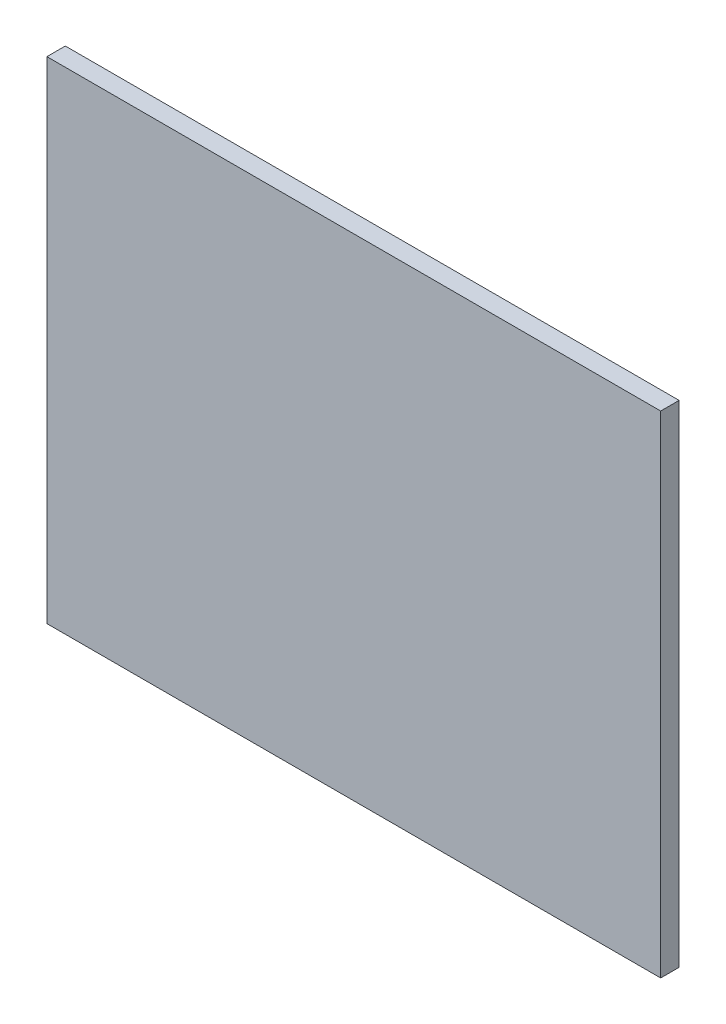
ISO-10303-21;
HEADER;
FILE_DESCRIPTION(('STEP AP214'),'2;1');
FILE_NAME('part.step','',(''),(''),'','','');
FILE_SCHEMA(('AUTOMOTIVE_DESIGN { 1 0 10303 214 1 1 1 1 }'));
ENDSEC;
DATA;
#1=APPLICATION_CONTEXT('core data for automotive mechanical design processes');
#2=APPLICATION_PROTOCOL_DEFINITION('international standard','automotive_design',2000,#1);
#3=PRODUCT_CONTEXT('',#1,'mechanical');
#4=PRODUCT('Part','Part','',(#3));
#5=PRODUCT_RELATED_PRODUCT_CATEGORY('part','',(#4));
#6=PRODUCT_DEFINITION_FORMATION('','',#4);
#7=PRODUCT_DEFINITION_CONTEXT('part definition',#1,'design');
#8=PRODUCT_DEFINITION('design','',#6,#7);
#9=PRODUCT_DEFINITION_SHAPE('','',#8);
#10=(LENGTH_UNIT() NAMED_UNIT(*) SI_UNIT(.MILLI.,.METRE.));
#11=(NAMED_UNIT(*) PLANE_ANGLE_UNIT() SI_UNIT($,.RADIAN.));
#12=(NAMED_UNIT(*) SI_UNIT($,.STERADIAN.) SOLID_ANGLE_UNIT());
#13=UNCERTAINTY_MEASURE_WITH_UNIT(LENGTH_MEASURE(1.E-05),#10,'distance_accuracy_value','');
#14=(GEOMETRIC_REPRESENTATION_CONTEXT(3) GLOBAL_UNCERTAINTY_ASSIGNED_CONTEXT((#13)) GLOBAL_UNIT_ASSIGNED_CONTEXT((#10,
#11,#12)) REPRESENTATION_CONTEXT('',''));
#15=CARTESIAN_POINT('',(0.,0.,0.));
#16=DIRECTION('',(0.,0.,1.));
#17=DIRECTION('',(1.,0.,0.));
#18=AXIS2_PLACEMENT_3D('',#15,#16,#17);
#19=CARTESIAN_POINT('',(-5.35211267605634,3.23943661971831,3.));
#20=DIRECTION('',(1.,0.,0.));
#21=DIRECTION('',(0.,1.,0.));
#22=AXIS2_PLACEMENT_3D('',#19,#20,#21);
#23=PLANE('',#22);
#24=DIRECTION('',(0.,-1.,0.));
#25=VECTOR('',#24,1.);
#26=CARTESIAN_POINT('',(-5.35211267605634,3.23943661971831,0.));
#27=LINE('',#26,#25);
#28=CARTESIAN_POINT('',(-5.35211267605634,3.23943661971831,0.));
#29=VERTEX_POINT('',#28);
#30=CARTESIAN_POINT('',(-5.35211267605633,-76.7605633802817,0.));
#31=VERTEX_POINT('',#30);
#32=EDGE_CURVE('E97',#29,#31,#27,.T.);
#33=ORIENTED_EDGE('',*,*,#32,.T.);
#34=DIRECTION('',(0.,0.,-1.));
#35=VECTOR('',#34,1.);
#36=CARTESIAN_POINT('',(-5.35211267605633,-76.7605633802817,3.));
#37=LINE('',#36,#35);
#38=CARTESIAN_POINT('',(-5.35211267605633,-76.7605633802817,3.));
#39=VERTEX_POINT('',#38);
#40=EDGE_CURVE('E11',#39,#31,#37,.T.);
#41=ORIENTED_EDGE('',*,*,#40,.F.);
#42=DIRECTION('',(0.,-1.,0.));
#43=VECTOR('',#42,1.);
#44=CARTESIAN_POINT('',(-5.35211267605634,3.23943661971831,3.));
#45=LINE('',#44,#43);
#46=CARTESIAN_POINT('',(-5.35211267605634,3.23943661971831,3.));
#47=VERTEX_POINT('',#46);
#48=EDGE_CURVE('E85',#47,#39,#45,.T.);
#49=ORIENTED_EDGE('',*,*,#48,.F.);
#50=DIRECTION('',(0.,0.,-1.));
#51=VECTOR('',#50,1.);
#52=CARTESIAN_POINT('',(-5.35211267605634,3.23943661971831,3.));
#53=LINE('',#52,#51);
#54=EDGE_CURVE('E93',#47,#29,#53,.T.);
#55=ORIENTED_EDGE('',*,*,#54,.T.);
#56=EDGE_LOOP('',(#33,#41,#49,#55));
#57=FACE_BOUND('',#56,.T.);
#58=ADVANCED_FACE('F34',(#57),#23,.F.);
#59=CARTESIAN_POINT('',(-5.35211267605633,-76.7605633802817,3.));
#60=DIRECTION('',(0.,1.,0.));
#61=DIRECTION('',(0.,0.,1.));
#62=AXIS2_PLACEMENT_3D('',#59,#60,#61);
#63=PLANE('',#62);
#64=DIRECTION('',(1.,0.,0.));
#65=VECTOR('',#64,1.);
#66=CARTESIAN_POINT('',(-5.35211267605633,-76.7605633802817,0.));
#67=LINE('',#66,#65);
#68=CARTESIAN_POINT('',(94.6478873239437,-76.7605633802817,0.));
#69=VERTEX_POINT('',#68);
#70=EDGE_CURVE('E89',#31,#69,#67,.T.);
#71=ORIENTED_EDGE('',*,*,#70,.T.);
#72=DIRECTION('',(0.,0.,-1.));
#73=VECTOR('',#72,1.);
#74=CARTESIAN_POINT('',(94.6478873239437,-76.7605633802817,3.));
#75=LINE('',#74,#73);
#76=CARTESIAN_POINT('',(94.6478873239437,-76.7605633802817,3.));
#77=VERTEX_POINT('',#76);
#78=EDGE_CURVE('E42',#77,#69,#75,.T.);
#79=ORIENTED_EDGE('',*,*,#78,.F.);
#80=DIRECTION('',(1.,0.,0.));
#81=VECTOR('',#80,1.);
#82=CARTESIAN_POINT('',(-5.35211267605633,-76.7605633802817,3.));
#83=LINE('',#82,#81);
#84=EDGE_CURVE('E80',#39,#77,#83,.T.);
#85=ORIENTED_EDGE('',*,*,#84,.F.);
#86=ORIENTED_EDGE('',*,*,#40,.T.);
#87=EDGE_LOOP('',(#71,#79,#85,#86));
#88=FACE_BOUND('',#87,.T.);
#89=ADVANCED_FACE('F88',(#88),#63,.F.);
#90=CARTESIAN_POINT('',(94.6478873239437,3.23943661971831,3.));
#91=DIRECTION('',(-1.,0.,0.));
#92=DIRECTION('',(0.,-1.,0.));
#93=AXIS2_PLACEMENT_3D('',#90,#91,#92);
#94=PLANE('',#93);
#95=DIRECTION('',(0.,1.,0.));
#96=VECTOR('',#95,1.);
#97=CARTESIAN_POINT('',(94.6478873239437,3.23943661971831,0.));
#98=LINE('',#97,#96);
#99=CARTESIAN_POINT('',(94.6478873239437,3.23943661971831,0.));
#100=VERTEX_POINT('',#99);
#101=EDGE_CURVE('E67',#69,#100,#98,.T.);
#102=ORIENTED_EDGE('',*,*,#101,.T.);
#103=DIRECTION('',(0.,0.,-1.));
#104=VECTOR('',#103,1.);
#105=CARTESIAN_POINT('',(94.6478873239437,3.23943661971831,3.));
#106=LINE('',#105,#104);
#107=CARTESIAN_POINT('',(94.6478873239437,3.23943661971831,3.));
#108=VERTEX_POINT('',#107);
#109=EDGE_CURVE('E90',#108,#100,#106,.T.);
#110=ORIENTED_EDGE('',*,*,#109,.F.);
#111=DIRECTION('',(0.,1.,0.));
#112=VECTOR('',#111,1.);
#113=CARTESIAN_POINT('',(94.6478873239437,3.23943661971831,3.));
#114=LINE('',#113,#112);
#115=EDGE_CURVE('E83',#77,#108,#114,.T.);
#116=ORIENTED_EDGE('',*,*,#115,.F.);
#117=ORIENTED_EDGE('',*,*,#78,.T.);
#118=EDGE_LOOP('',(#102,#110,#116,#117));
#119=FACE_BOUND('',#118,.T.);
#120=ADVANCED_FACE('F91',(#119),#94,.F.);
#121=CARTESIAN_POINT('',(-5.35211267605634,3.23943661971831,3.));
#122=DIRECTION('',(0.,-1.,0.));
#123=DIRECTION('',(0.,0.,-1.));
#124=AXIS2_PLACEMENT_3D('',#121,#122,#123);
#125=PLANE('',#124);
#126=DIRECTION('',(-1.,0.,0.));
#127=VECTOR('',#126,1.);
#128=CARTESIAN_POINT('',(-5.35211267605634,3.23943661971831,0.));
#129=LINE('',#128,#127);
#130=EDGE_CURVE('E73',#100,#29,#129,.T.);
#131=ORIENTED_EDGE('',*,*,#130,.T.);
#132=ORIENTED_EDGE('',*,*,#54,.F.);
#133=DIRECTION('',(-1.,0.,0.));
#134=VECTOR('',#133,1.);
#135=CARTESIAN_POINT('',(-5.35211267605634,3.23943661971831,3.));
#136=LINE('',#135,#134);
#137=EDGE_CURVE('E50',#108,#47,#136,.T.);
#138=ORIENTED_EDGE('',*,*,#137,.F.);
#139=ORIENTED_EDGE('',*,*,#109,.T.);
#140=EDGE_LOOP('',(#131,#132,#138,#139));
#141=FACE_BOUND('',#140,.T.);
#142=ADVANCED_FACE('F104',(#141),#125,.F.);
#143=CARTESIAN_POINT('',(0.,0.,3.));
#144=DIRECTION('',(0.,0.,1.));
#145=DIRECTION('',(1.,0.,0.));
#146=AXIS2_PLACEMENT_3D('',#143,#144,#145);
#147=PLANE('',#146);
#148=ORIENTED_EDGE('',*,*,#48,.T.);
#149=ORIENTED_EDGE('',*,*,#84,.T.);
#150=ORIENTED_EDGE('',*,*,#115,.T.);
#151=ORIENTED_EDGE('',*,*,#137,.T.);
#152=EDGE_LOOP('',(#148,#149,#150,#151));
#153=FACE_BOUND('',#152,.T.);
#154=ADVANCED_FACE('F81',(#153),#147,.T.);
#155=CARTESIAN_POINT('',(0.,0.,0.));
#156=DIRECTION('',(0.,0.,1.));
#157=DIRECTION('',(1.,0.,0.));
#158=AXIS2_PLACEMENT_3D('',#155,#156,#157);
#159=PLANE('',#158);
#160=ORIENTED_EDGE('',*,*,#32,.F.);
#161=ORIENTED_EDGE('',*,*,#130,.F.);
#162=ORIENTED_EDGE('',*,*,#101,.F.);
#163=ORIENTED_EDGE('',*,*,#70,.F.);
#164=EDGE_LOOP('',(#160,#161,#162,#163));
#165=FACE_BOUND('',#164,.T.);
#166=ADVANCED_FACE('F107',(#165),#159,.F.);
#167=CLOSED_SHELL('',(#58,#89,#120,#142,#154,#166));
#168=MANIFOLD_SOLID_BREP('B2',#167);
#169=ADVANCED_BREP_SHAPE_REPRESENTATION('',(#18,#168),#14);
#170=SHAPE_DEFINITION_REPRESENTATION(#9,#169);
ENDSEC;
END-ISO-10303-21;
